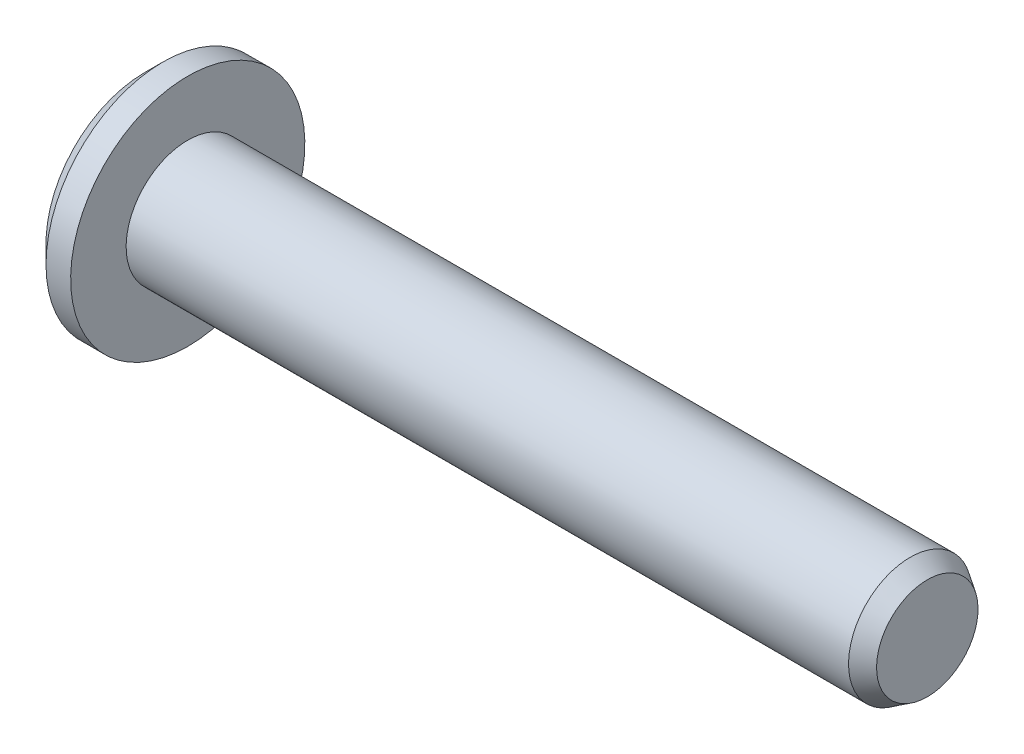
ISO-10303-21;
HEADER;
FILE_DESCRIPTION(('STEP AP214'),'2;1');
FILE_NAME('part.step','',(''),(''),'','','');
FILE_SCHEMA(('AUTOMOTIVE_DESIGN { 1 0 10303 214 1 1 1 1 }'));
ENDSEC;
DATA;
#1=APPLICATION_CONTEXT('core data for automotive mechanical design processes');
#2=APPLICATION_PROTOCOL_DEFINITION('international standard','automotive_design',2000,#1);
#3=PRODUCT_CONTEXT('',#1,'mechanical');
#4=PRODUCT('Part','Part','',(#3));
#5=PRODUCT_RELATED_PRODUCT_CATEGORY('part','',(#4));
#6=PRODUCT_DEFINITION_FORMATION('','',#4);
#7=PRODUCT_DEFINITION_CONTEXT('part definition',#1,'design');
#8=PRODUCT_DEFINITION('design','',#6,#7);
#9=PRODUCT_DEFINITION_SHAPE('','',#8);
#10=(LENGTH_UNIT() NAMED_UNIT(*) SI_UNIT(.MILLI.,.METRE.));
#11=(NAMED_UNIT(*) PLANE_ANGLE_UNIT() SI_UNIT($,.RADIAN.));
#12=(NAMED_UNIT(*) SI_UNIT($,.STERADIAN.) SOLID_ANGLE_UNIT());
#13=UNCERTAINTY_MEASURE_WITH_UNIT(LENGTH_MEASURE(1.E-05),#10,'distance_accuracy_value','');
#14=(GEOMETRIC_REPRESENTATION_CONTEXT(3) GLOBAL_UNCERTAINTY_ASSIGNED_CONTEXT((#13)) GLOBAL_UNIT_ASSIGNED_CONTEXT((#10,
#11,#12)) REPRESENTATION_CONTEXT('',''));
#15=CARTESIAN_POINT('',(0.,0.,0.));
#16=DIRECTION('',(0.,0.,1.));
#17=DIRECTION('',(1.,0.,0.));
#18=AXIS2_PLACEMENT_3D('',#15,#16,#17);
#19=CARTESIAN_POINT('',(31.75,0.,0.));
#20=DIRECTION('',(-1.,0.,0.));
#21=DIRECTION('',(0.,-1.,0.));
#22=AXIS2_PLACEMENT_3D('',#19,#20,#21);
#23=PLANE('',#22);
#24=CARTESIAN_POINT('',(31.75,0.,0.));
#25=DIRECTION('',(-1.,0.,0.));
#26=DIRECTION('',(0.,-1.,0.));
#27=AXIS2_PLACEMENT_3D('',#24,#25,#26);
#28=CIRCLE('',#27,2.05723616873881);
#29=CARTESIAN_POINT('',(31.75,-2.05723616873881,0.));
#30=VERTEX_POINT('',#29);
#31=EDGE_CURVE('E149',#30,#30,#28,.T.);
#32=ORIENTED_EDGE('',*,*,#31,.F.);
#33=EDGE_LOOP('',(#32));
#34=FACE_BOUND('',#33,.T.);
#35=ADVANCED_FACE('F33',(#34),#23,.F.);
#36=CARTESIAN_POINT('',(31.75,0.,0.));
#37=DIRECTION('',(-1.,0.,0.));
#38=DIRECTION('',(0.,-1.,0.));
#39=AXIS2_PLACEMENT_3D('',#36,#37,#38);
#40=CONICAL_SURFACE('',#39,2.05723616873881,0.567232006898154);
#41=CARTESIAN_POINT('',(31.055,0.,0.));
#42=DIRECTION('',(-1.,0.,0.));
#43=DIRECTION('',(0.,-1.,0.));
#44=AXIS2_PLACEMENT_3D('',#41,#42,#43);
#45=CIRCLE('',#44,2.50000000000003);
#46=CARTESIAN_POINT('',(31.055,-2.50000000000003,0.));
#47=VERTEX_POINT('',#46);
#48=EDGE_CURVE('E146',#47,#47,#45,.T.);
#49=ORIENTED_EDGE('',*,*,#48,.F.);
#50=EDGE_LOOP('',(#49));
#51=FACE_BOUND('',#50,.T.);
#52=ORIENTED_EDGE('',*,*,#31,.T.);
#53=EDGE_LOOP('',(#52));
#54=FACE_BOUND('',#53,.T.);
#55=ADVANCED_FACE('F166',(#51,#54),#40,.T.);
#56=CARTESIAN_POINT('',(0.,0.,0.));
#57=DIRECTION('',(-1.,0.,0.));
#58=DIRECTION('',(0.,-1.,0.));
#59=AXIS2_PLACEMENT_3D('',#56,#57,#58);
#60=CYLINDRICAL_SURFACE('',#59,2.50000000000002);
#61=CARTESIAN_POINT('',(1.75,0.,0.));
#62=DIRECTION('',(-1.,0.,0.));
#63=DIRECTION('',(0.,-1.,0.));
#64=AXIS2_PLACEMENT_3D('',#61,#62,#63);
#65=CIRCLE('',#64,2.50000000000002);
#66=CARTESIAN_POINT('',(1.75,-2.50000000000002,0.));
#67=VERTEX_POINT('',#66);
#68=EDGE_CURVE('E143',#67,#67,#65,.T.);
#69=ORIENTED_EDGE('',*,*,#68,.F.);
#70=EDGE_LOOP('',(#69));
#71=FACE_BOUND('',#70,.T.);
#72=ORIENTED_EDGE('',*,*,#48,.T.);
#73=EDGE_LOOP('',(#72));
#74=FACE_BOUND('',#73,.T.);
#75=ADVANCED_FACE('F171',(#71,#74),#60,.T.);
#76=CARTESIAN_POINT('',(1.75,2.50000000000002,0.));
#77=DIRECTION('',(-1.,0.,0.));
#78=DIRECTION('',(0.,-1.,0.));
#79=AXIS2_PLACEMENT_3D('',#76,#77,#78);
#80=PLANE('',#79);
#81=CARTESIAN_POINT('',(1.75,0.,0.));
#82=DIRECTION('',(-1.,0.,0.));
#83=DIRECTION('',(0.,-1.,0.));
#84=AXIS2_PLACEMENT_3D('',#81,#82,#83);
#85=CIRCLE('',#84,4.75000000000001);
#86=CARTESIAN_POINT('',(1.75,-4.75000000000001,0.));
#87=VERTEX_POINT('',#86);
#88=EDGE_CURVE('E135',#87,#87,#85,.T.);
#89=ORIENTED_EDGE('',*,*,#88,.F.);
#90=EDGE_LOOP('',(#89));
#91=FACE_BOUND('',#90,.T.);
#92=ORIENTED_EDGE('',*,*,#68,.T.);
#93=EDGE_LOOP('',(#92));
#94=FACE_BOUND('',#93,.T.);
#95=ADVANCED_FACE('F178',(#91,#94),#80,.F.);
#96=CARTESIAN_POINT('',(0.,0.,0.));
#97=DIRECTION('',(-1.,0.,0.));
#98=DIRECTION('',(0.,-1.,0.));
#99=AXIS2_PLACEMENT_3D('',#96,#97,#98);
#100=CYLINDRICAL_SURFACE('',#99,4.75000000000001);
#101=CARTESIAN_POINT('',(0.749999999999998,0.,0.));
#102=DIRECTION('',(1.,0.,0.));
#103=DIRECTION('',(0.,1.,0.));
#104=AXIS2_PLACEMENT_3D('',#101,#102,#103);
#105=CIRCLE('',#104,4.75000000000001);
#106=CARTESIAN_POINT('',(0.749999999999999,4.75000000000001,0.));
#107=VERTEX_POINT('',#106);
#108=EDGE_CURVE('E11',#107,#107,#105,.T.);
#109=ORIENTED_EDGE('',*,*,#108,.T.);
#110=EDGE_LOOP('',(#109));
#111=FACE_BOUND('',#110,.T.);
#112=ORIENTED_EDGE('',*,*,#88,.T.);
#113=EDGE_LOOP('',(#112));
#114=FACE_BOUND('',#113,.T.);
#115=ADVANCED_FACE('F182',(#111,#114),#100,.T.);
#116=CARTESIAN_POINT('',(0.,4.75000000000001,0.));
#117=DIRECTION('',(1.,0.,0.));
#118=DIRECTION('',(0.,1.,0.));
#119=AXIS2_PLACEMENT_3D('',#116,#117,#118);
#120=PLANE('',#119);
#121=CARTESIAN_POINT('',(0.,0.,0.));
#122=DIRECTION('',(1.,0.,0.));
#123=DIRECTION('',(0.,1.,0.));
#124=AXIS2_PLACEMENT_3D('',#121,#122,#123);
#125=CIRCLE('',#124,4.00000000000001);
#126=CARTESIAN_POINT('',(0.,4.00000000000001,0.));
#127=VERTEX_POINT('',#126);
#128=EDGE_CURVE('E41',#127,#127,#125,.F.);
#129=ORIENTED_EDGE('',*,*,#128,.T.);
#130=EDGE_LOOP('',(#129));
#131=FACE_BOUND('',#130,.T.);
#132=DIRECTION('',(0.,1.,0.));
#133=VECTOR('',#132,1.);
#134=CARTESIAN_POINT('',(0.,-0.866025403784439,1.5));
#135=LINE('',#134,#133);
#136=CARTESIAN_POINT('',(0.,-0.86602540378444,1.5));
#137=VERTEX_POINT('',#136);
#138=CARTESIAN_POINT('',(0.,0.86602540378444,1.5));
#139=VERTEX_POINT('',#138);
#140=EDGE_CURVE('E122',#137,#139,#135,.T.);
#141=ORIENTED_EDGE('',*,*,#140,.F.);
#142=DIRECTION('',(0.,0.5,0.866025403784439));
#143=VECTOR('',#142,1.);
#144=CARTESIAN_POINT('',(0.,-1.73205080756888,0.));
#145=LINE('',#144,#143);
#146=CARTESIAN_POINT('',(0.,-1.73205080756888,0.));
#147=VERTEX_POINT('',#146);
#148=EDGE_CURVE('E48',#147,#137,#145,.T.);
#149=ORIENTED_EDGE('',*,*,#148,.F.);
#150=DIRECTION('',(0.,-0.5,0.866025403784439));
#151=VECTOR('',#150,1.);
#152=CARTESIAN_POINT('',(0.,-0.866025403784439,-1.5));
#153=LINE('',#152,#151);
#154=CARTESIAN_POINT('',(0.,-0.866025403784439,-1.5));
#155=VERTEX_POINT('',#154);
#156=EDGE_CURVE('E131',#155,#147,#153,.T.);
#157=ORIENTED_EDGE('',*,*,#156,.F.);
#158=DIRECTION('',(0.,-1.,0.));
#159=VECTOR('',#158,1.);
#160=CARTESIAN_POINT('',(0.,0.86602540378444,-1.5));
#161=LINE('',#160,#159);
#162=CARTESIAN_POINT('',(0.,0.86602540378444,-1.5));
#163=VERTEX_POINT('',#162);
#164=EDGE_CURVE('E129',#163,#155,#161,.T.);
#165=ORIENTED_EDGE('',*,*,#164,.F.);
#166=DIRECTION('',(0.,-0.5,-0.866025403784439));
#167=VECTOR('',#166,1.);
#168=CARTESIAN_POINT('',(0.,1.73205080756888,0.));
#169=LINE('',#168,#167);
#170=CARTESIAN_POINT('',(0.,1.73205080756888,0.));
#171=VERTEX_POINT('',#170);
#172=EDGE_CURVE('E96',#171,#163,#169,.T.);
#173=ORIENTED_EDGE('',*,*,#172,.F.);
#174=DIRECTION('',(0.,0.5,-0.866025403784439));
#175=VECTOR('',#174,1.);
#176=CARTESIAN_POINT('',(0.,0.86602540378444,1.5));
#177=LINE('',#176,#175);
#178=EDGE_CURVE('E125',#139,#171,#177,.T.);
#179=ORIENTED_EDGE('',*,*,#178,.F.);
#180=EDGE_LOOP('',(#141,#149,#157,#165,#173,#179));
#181=FACE_BOUND('',#180,.T.);
#182=ADVANCED_FACE('F154',(#131,#181),#120,.F.);
#183=CARTESIAN_POINT('',(1.,-1.73205080756888,0.));
#184=DIRECTION('',(0.,-0.866025403784439,0.5));
#185=DIRECTION('',(0.,-0.5,-0.866025403784439));
#186=AXIS2_PLACEMENT_3D('',#183,#184,#185);
#187=PLANE('',#186);
#188=ORIENTED_EDGE('',*,*,#148,.T.);
#189=DIRECTION('',(-1.,0.,0.));
#190=VECTOR('',#189,1.);
#191=CARTESIAN_POINT('',(1.,-0.866025403784439,1.5));
#192=LINE('',#191,#190);
#193=CARTESIAN_POINT('',(1.,-0.866025403784439,1.5));
#194=VERTEX_POINT('',#193);
#195=EDGE_CURVE('E78',#194,#137,#192,.T.);
#196=ORIENTED_EDGE('',*,*,#195,.F.);
#197=DIRECTION('',(0.,0.5,0.866025403784439));
#198=VECTOR('',#197,1.);
#199=CARTESIAN_POINT('',(1.,-1.73205080756888,0.));
#200=LINE('',#199,#198);
#201=CARTESIAN_POINT('',(1.,-1.73205080756888,0.));
#202=VERTEX_POINT('',#201);
#203=EDGE_CURVE('E133',#202,#194,#200,.T.);
#204=ORIENTED_EDGE('',*,*,#203,.F.);
#205=DIRECTION('',(-1.,0.,0.));
#206=VECTOR('',#205,1.);
#207=CARTESIAN_POINT('',(1.,-1.73205080756888,0.));
#208=LINE('',#207,#206);
#209=EDGE_CURVE('E56',#202,#147,#208,.T.);
#210=ORIENTED_EDGE('',*,*,#209,.T.);
#211=EDGE_LOOP('',(#188,#196,#204,#210));
#212=FACE_BOUND('',#211,.T.);
#213=ADVANCED_FACE('F189',(#212),#187,.F.);
#214=CARTESIAN_POINT('',(1.,-0.866025403784439,-1.5));
#215=DIRECTION('',(0.,-0.866025403784439,-0.5));
#216=DIRECTION('',(0.,0.5,-0.866025403784439));
#217=AXIS2_PLACEMENT_3D('',#214,#215,#216);
#218=PLANE('',#217);
#219=ORIENTED_EDGE('',*,*,#156,.T.);
#220=ORIENTED_EDGE('',*,*,#209,.F.);
#221=DIRECTION('',(0.,-0.5,0.866025403784439));
#222=VECTOR('',#221,1.);
#223=CARTESIAN_POINT('',(1.,-0.866025403784439,-1.5));
#224=LINE('',#223,#222);
#225=CARTESIAN_POINT('',(1.,-0.866025403784439,-1.5));
#226=VERTEX_POINT('',#225);
#227=EDGE_CURVE('E108',#226,#202,#224,.T.);
#228=ORIENTED_EDGE('',*,*,#227,.F.);
#229=DIRECTION('',(-1.,0.,0.));
#230=VECTOR('',#229,1.);
#231=CARTESIAN_POINT('',(1.,-0.866025403784439,-1.5));
#232=LINE('',#231,#230);
#233=EDGE_CURVE('E100',#226,#155,#232,.T.);
#234=ORIENTED_EDGE('',*,*,#233,.T.);
#235=EDGE_LOOP('',(#219,#220,#228,#234));
#236=FACE_BOUND('',#235,.T.);
#237=ADVANCED_FACE('F192',(#236),#218,.F.);
#238=CARTESIAN_POINT('',(1.,0.86602540378444,-1.5));
#239=DIRECTION('',(0.,0.,-1.));
#240=DIRECTION('',(0.,1.,0.));
#241=AXIS2_PLACEMENT_3D('',#238,#239,#240);
#242=PLANE('',#241);
#243=ORIENTED_EDGE('',*,*,#164,.T.);
#244=ORIENTED_EDGE('',*,*,#233,.F.);
#245=DIRECTION('',(0.,-1.,0.));
#246=VECTOR('',#245,1.);
#247=CARTESIAN_POINT('',(1.,0.86602540378444,-1.5));
#248=LINE('',#247,#246);
#249=CARTESIAN_POINT('',(1.,0.86602540378444,-1.5));
#250=VERTEX_POINT('',#249);
#251=EDGE_CURVE('E104',#250,#226,#248,.T.);
#252=ORIENTED_EDGE('',*,*,#251,.F.);
#253=DIRECTION('',(-1.,0.,0.));
#254=VECTOR('',#253,1.);
#255=CARTESIAN_POINT('',(1.,0.86602540378444,-1.5));
#256=LINE('',#255,#254);
#257=EDGE_CURVE('E89',#250,#163,#256,.T.);
#258=ORIENTED_EDGE('',*,*,#257,.T.);
#259=EDGE_LOOP('',(#243,#244,#252,#258));
#260=FACE_BOUND('',#259,.T.);
#261=ADVANCED_FACE('F105',(#260),#242,.F.);
#262=CARTESIAN_POINT('',(1.,1.73205080756888,0.));
#263=DIRECTION('',(0.,0.866025403784439,-0.5));
#264=DIRECTION('',(0.,0.5,0.866025403784439));
#265=AXIS2_PLACEMENT_3D('',#262,#263,#264);
#266=PLANE('',#265);
#267=ORIENTED_EDGE('',*,*,#172,.T.);
#268=ORIENTED_EDGE('',*,*,#257,.F.);
#269=DIRECTION('',(0.,-0.5,-0.866025403784439));
#270=VECTOR('',#269,1.);
#271=CARTESIAN_POINT('',(1.,1.73205080756888,0.));
#272=LINE('',#271,#270);
#273=CARTESIAN_POINT('',(1.,1.73205080756888,0.));
#274=VERTEX_POINT('',#273);
#275=EDGE_CURVE('E93',#274,#250,#272,.T.);
#276=ORIENTED_EDGE('',*,*,#275,.F.);
#277=DIRECTION('',(-1.,0.,0.));
#278=VECTOR('',#277,1.);
#279=CARTESIAN_POINT('',(1.,1.73205080756888,0.));
#280=LINE('',#279,#278);
#281=EDGE_CURVE('E101',#274,#171,#280,.T.);
#282=ORIENTED_EDGE('',*,*,#281,.T.);
#283=EDGE_LOOP('',(#267,#268,#276,#282));
#284=FACE_BOUND('',#283,.T.);
#285=ADVANCED_FACE('F91',(#284),#266,.F.);
#286=CARTESIAN_POINT('',(1.,0.86602540378444,1.5));
#287=DIRECTION('',(0.,0.866025403784439,0.5));
#288=DIRECTION('',(0.,-0.5,0.866025403784439));
#289=AXIS2_PLACEMENT_3D('',#286,#287,#288);
#290=PLANE('',#289);
#291=ORIENTED_EDGE('',*,*,#178,.T.);
#292=ORIENTED_EDGE('',*,*,#281,.F.);
#293=DIRECTION('',(0.,0.5,-0.866025403784439));
#294=VECTOR('',#293,1.);
#295=CARTESIAN_POINT('',(1.,0.86602540378444,1.5));
#296=LINE('',#295,#294);
#297=CARTESIAN_POINT('',(1.,0.86602540378444,1.5));
#298=VERTEX_POINT('',#297);
#299=EDGE_CURVE('E114',#298,#274,#296,.T.);
#300=ORIENTED_EDGE('',*,*,#299,.F.);
#301=DIRECTION('',(-1.,0.,0.));
#302=VECTOR('',#301,1.);
#303=CARTESIAN_POINT('',(1.,0.86602540378444,1.5));
#304=LINE('',#303,#302);
#305=EDGE_CURVE('E138',#298,#139,#304,.T.);
#306=ORIENTED_EDGE('',*,*,#305,.T.);
#307=EDGE_LOOP('',(#291,#292,#300,#306));
#308=FACE_BOUND('',#307,.T.);
#309=ADVANCED_FACE('F195',(#308),#290,.F.);
#310=CARTESIAN_POINT('',(1.,-0.866025403784439,1.5));
#311=DIRECTION('',(0.,0.,1.));
#312=DIRECTION('',(0.,-1.,0.));
#313=AXIS2_PLACEMENT_3D('',#310,#311,#312);
#314=PLANE('',#313);
#315=ORIENTED_EDGE('',*,*,#140,.T.);
#316=ORIENTED_EDGE('',*,*,#305,.F.);
#317=DIRECTION('',(0.,1.,0.));
#318=VECTOR('',#317,1.);
#319=CARTESIAN_POINT('',(1.,-0.866025403784439,1.5));
#320=LINE('',#319,#318);
#321=EDGE_CURVE('E116',#194,#298,#320,.T.);
#322=ORIENTED_EDGE('',*,*,#321,.F.);
#323=ORIENTED_EDGE('',*,*,#195,.T.);
#324=EDGE_LOOP('',(#315,#316,#322,#323));
#325=FACE_BOUND('',#324,.T.);
#326=ADVANCED_FACE('F162',(#325),#314,.F.);
#327=CARTESIAN_POINT('',(1.,0.,0.));
#328=DIRECTION('',(-1.,0.,0.));
#329=DIRECTION('',(0.,-1.,0.));
#330=AXIS2_PLACEMENT_3D('',#327,#328,#329);
#331=PLANE('',#330);
#332=ORIENTED_EDGE('',*,*,#203,.T.);
#333=ORIENTED_EDGE('',*,*,#321,.T.);
#334=ORIENTED_EDGE('',*,*,#299,.T.);
#335=ORIENTED_EDGE('',*,*,#275,.T.);
#336=ORIENTED_EDGE('',*,*,#251,.T.);
#337=ORIENTED_EDGE('',*,*,#227,.T.);
#338=EDGE_LOOP('',(#332,#333,#334,#335,#336,#337));
#339=FACE_BOUND('',#338,.T.);
#340=ADVANCED_FACE('F111',(#339),#331,.T.);
#341=CARTESIAN_POINT('',(0.,0.,0.));
#342=DIRECTION('',(1.,0.,0.));
#343=DIRECTION('',(0.,1.,0.));
#344=AXIS2_PLACEMENT_3D('',#341,#342,#343);
#345=CONICAL_SURFACE('',#344,4.00000000000001,0.785398163397447);
#346=ORIENTED_EDGE('',*,*,#108,.F.);
#347=EDGE_LOOP('',(#346));
#348=FACE_BOUND('',#347,.T.);
#349=ORIENTED_EDGE('',*,*,#128,.F.);
#350=EDGE_LOOP('',(#349));
#351=FACE_BOUND('',#350,.T.);
#352=ADVANCED_FACE('F35',(#348,#351),#345,.T.);
#353=CLOSED_SHELL('',(#35,#55,#75,#95,#115,#182,#213,#237,#261,#285,#309,#326,#340,#352));
#354=MANIFOLD_SOLID_BREP('B2',#353);
#355=ADVANCED_BREP_SHAPE_REPRESENTATION('',(#18,#354),#14);
#356=SHAPE_DEFINITION_REPRESENTATION(#9,#355);
ENDSEC;
END-ISO-10303-21;
